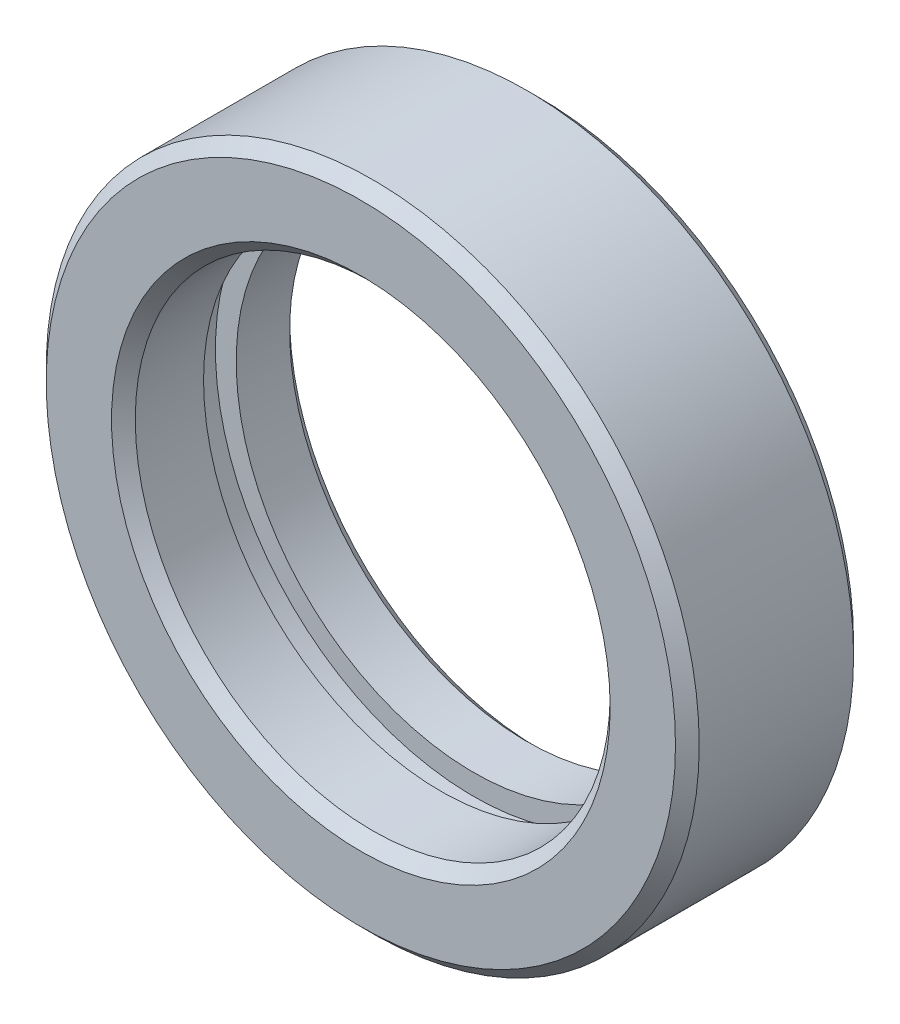
ISO-10303-21;
HEADER;
FILE_DESCRIPTION(('STEP AP214'),'2;1');
FILE_NAME('part.step','',(''),(''),'','','');
FILE_SCHEMA(('AUTOMOTIVE_DESIGN { 1 0 10303 214 1 1 1 1 }'));
ENDSEC;
DATA;
#1=APPLICATION_CONTEXT('core data for automotive mechanical design processes');
#2=APPLICATION_PROTOCOL_DEFINITION('international standard','automotive_design',2000,#1);
#3=PRODUCT_CONTEXT('',#1,'mechanical');
#4=PRODUCT('Part','Part','',(#3));
#5=PRODUCT_RELATED_PRODUCT_CATEGORY('part','',(#4));
#6=PRODUCT_DEFINITION_FORMATION('','',#4);
#7=PRODUCT_DEFINITION_CONTEXT('part definition',#1,'design');
#8=PRODUCT_DEFINITION('design','',#6,#7);
#9=PRODUCT_DEFINITION_SHAPE('','',#8);
#10=(LENGTH_UNIT() NAMED_UNIT(*) SI_UNIT(.MILLI.,.METRE.));
#11=(NAMED_UNIT(*) PLANE_ANGLE_UNIT() SI_UNIT($,.RADIAN.));
#12=(NAMED_UNIT(*) SI_UNIT($,.STERADIAN.) SOLID_ANGLE_UNIT());
#13=UNCERTAINTY_MEASURE_WITH_UNIT(LENGTH_MEASURE(1.E-05),#10,'distance_accuracy_value','');
#14=(GEOMETRIC_REPRESENTATION_CONTEXT(3) GLOBAL_UNCERTAINTY_ASSIGNED_CONTEXT((#13)) GLOBAL_UNIT_ASSIGNED_CONTEXT((#10,
#11,#12)) REPRESENTATION_CONTEXT('',''));
#15=CARTESIAN_POINT('',(0.,0.,0.));
#16=DIRECTION('',(0.,0.,1.));
#17=DIRECTION('',(1.,0.,0.));
#18=AXIS2_PLACEMENT_3D('',#15,#16,#17);
#19=CARTESIAN_POINT('',(0.,0.,15.));
#20=DIRECTION('',(0.,0.,-1.));
#21=DIRECTION('',(-1.,0.,0.));
#22=AXIS2_PLACEMENT_3D('',#19,#20,#21);
#23=CYLINDRICAL_SURFACE('',#22,40.);
#24=CARTESIAN_POINT('',(0.,0.,13.));
#25=DIRECTION('',(0.,0.,1.));
#26=DIRECTION('',(1.,0.,0.));
#27=AXIS2_PLACEMENT_3D('',#24,#25,#26);
#28=CIRCLE('',#27,40.);
#29=CARTESIAN_POINT('',(40.,0.,13.));
#30=VERTEX_POINT('',#29);
#31=EDGE_CURVE('E66',#30,#30,#28,.T.);
#32=ORIENTED_EDGE('',*,*,#31,.T.);
#33=EDGE_LOOP('',(#32));
#34=FACE_BOUND('',#33,.T.);
#35=CARTESIAN_POINT('',(0.,0.,1.5));
#36=DIRECTION('',(0.,0.,-1.));
#37=DIRECTION('',(-1.,0.,0.));
#38=AXIS2_PLACEMENT_3D('',#35,#36,#37);
#39=CIRCLE('',#38,40.);
#40=CARTESIAN_POINT('',(-40.,0.,1.5));
#41=VERTEX_POINT('',#40);
#42=EDGE_CURVE('E34',#41,#41,#39,.T.);
#43=ORIENTED_EDGE('',*,*,#42,.T.);
#44=EDGE_LOOP('',(#43));
#45=FACE_BOUND('',#44,.T.);
#46=ADVANCED_FACE('F30',(#34,#45),#23,.F.);
#47=CARTESIAN_POINT('',(0.,0.,-13.));
#48=DIRECTION('',(0.,0.,1.));
#49=DIRECTION('',(1.,0.,0.));
#50=AXIS2_PLACEMENT_3D('',#47,#48,#49);
#51=CIRCLE('',#50,40.);
#52=CARTESIAN_POINT('',(40.,0.,-13.));
#53=VERTEX_POINT('',#52);
#54=EDGE_CURVE('E69',#53,#53,#51,.F.);
#55=ORIENTED_EDGE('',*,*,#54,.T.);
#56=EDGE_LOOP('',(#55));
#57=FACE_BOUND('',#56,.T.);
#58=CARTESIAN_POINT('',(0.,0.,-4.));
#59=DIRECTION('',(0.,0.,1.));
#60=DIRECTION('',(1.,0.,0.));
#61=AXIS2_PLACEMENT_3D('',#58,#59,#60);
#62=CIRCLE('',#61,40.);
#63=CARTESIAN_POINT('',(40.,0.,-4.));
#64=VERTEX_POINT('',#63);
#65=EDGE_CURVE('E46',#64,#64,#62,.T.);
#66=ORIENTED_EDGE('',*,*,#65,.T.);
#67=EDGE_LOOP('',(#66));
#68=FACE_BOUND('',#67,.T.);
#69=ADVANCED_FACE('F90',(#57,#68),#23,.F.);
#70=CARTESIAN_POINT('',(0.,0.,15.));
#71=DIRECTION('',(0.,0.,1.));
#72=DIRECTION('',(1.,0.,0.));
#73=AXIS2_PLACEMENT_3D('',#70,#71,#72);
#74=PLANE('',#73);
#75=CARTESIAN_POINT('',(0.,0.,15.));
#76=DIRECTION('',(0.,0.,1.));
#77=DIRECTION('',(1.,0.,0.));
#78=AXIS2_PLACEMENT_3D('',#75,#76,#77);
#79=CIRCLE('',#78,42.);
#80=CARTESIAN_POINT('',(42.,0.,15.));
#81=VERTEX_POINT('',#80);
#82=EDGE_CURVE('E43',#81,#81,#79,.F.);
#83=ORIENTED_EDGE('',*,*,#82,.T.);
#84=EDGE_LOOP('',(#83));
#85=FACE_BOUND('',#84,.T.);
#86=CARTESIAN_POINT('',(0.,0.,15.));
#87=DIRECTION('',(0.,0.,1.));
#88=DIRECTION('',(1.,0.,0.));
#89=AXIS2_PLACEMENT_3D('',#86,#87,#88);
#90=CIRCLE('',#89,53.);
#91=CARTESIAN_POINT('',(53.,0.,15.));
#92=VERTEX_POINT('',#91);
#93=EDGE_CURVE('E72',#92,#92,#90,.T.);
#94=ORIENTED_EDGE('',*,*,#93,.T.);
#95=EDGE_LOOP('',(#94));
#96=FACE_BOUND('',#95,.T.);
#97=ADVANCED_FACE('F77',(#85,#96),#74,.T.);
#98=CARTESIAN_POINT('',(0.,0.,-15.));
#99=DIRECTION('',(0.,0.,1.));
#100=DIRECTION('',(1.,0.,0.));
#101=AXIS2_PLACEMENT_3D('',#98,#99,#100);
#102=PLANE('',#101);
#103=CARTESIAN_POINT('',(0.,0.,-15.));
#104=DIRECTION('',(0.,0.,1.));
#105=DIRECTION('',(1.,0.,0.));
#106=AXIS2_PLACEMENT_3D('',#103,#104,#105);
#107=CIRCLE('',#106,42.);
#108=CARTESIAN_POINT('',(42.,0.,-15.));
#109=VERTEX_POINT('',#108);
#110=EDGE_CURVE('E63',#109,#109,#107,.T.);
#111=ORIENTED_EDGE('',*,*,#110,.T.);
#112=EDGE_LOOP('',(#111));
#113=FACE_BOUND('',#112,.T.);
#114=CARTESIAN_POINT('',(0.,0.,-15.));
#115=DIRECTION('',(0.,0.,1.));
#116=DIRECTION('',(1.,0.,0.));
#117=AXIS2_PLACEMENT_3D('',#114,#115,#116);
#118=CIRCLE('',#117,53.);
#119=CARTESIAN_POINT('',(53.,0.,-15.));
#120=VERTEX_POINT('',#119);
#121=EDGE_CURVE('E52',#120,#120,#118,.F.);
#122=ORIENTED_EDGE('',*,*,#121,.T.);
#123=EDGE_LOOP('',(#122));
#124=FACE_BOUND('',#123,.T.);
#125=ADVANCED_FACE('F111',(#113,#124),#102,.F.);
#126=CARTESIAN_POINT('',(0.,0.,15.));
#127=DIRECTION('',(0.,0.,-1.));
#128=DIRECTION('',(-1.,0.,0.));
#129=AXIS2_PLACEMENT_3D('',#126,#127,#128);
#130=CYLINDRICAL_SURFACE('',#129,55.);
#131=CARTESIAN_POINT('',(0.,0.,-13.));
#132=DIRECTION('',(0.,0.,1.));
#133=DIRECTION('',(1.,0.,0.));
#134=AXIS2_PLACEMENT_3D('',#131,#132,#133);
#135=CIRCLE('',#134,55.);
#136=CARTESIAN_POINT('',(55.,0.,-13.));
#137=VERTEX_POINT('',#136);
#138=EDGE_CURVE('E10',#137,#137,#135,.T.);
#139=ORIENTED_EDGE('',*,*,#138,.T.);
#140=EDGE_LOOP('',(#139));
#141=FACE_BOUND('',#140,.T.);
#142=CARTESIAN_POINT('',(0.,0.,13.));
#143=DIRECTION('',(0.,0.,1.));
#144=DIRECTION('',(1.,0.,0.));
#145=AXIS2_PLACEMENT_3D('',#142,#143,#144);
#146=CIRCLE('',#145,55.);
#147=CARTESIAN_POINT('',(55.,0.,13.));
#148=VERTEX_POINT('',#147);
#149=EDGE_CURVE('E38',#148,#148,#146,.F.);
#150=ORIENTED_EDGE('',*,*,#149,.T.);
#151=EDGE_LOOP('',(#150));
#152=FACE_BOUND('',#151,.T.);
#153=ADVANCED_FACE('F114',(#141,#152),#130,.T.);
#154=CARTESIAN_POINT('',(0.,0.,-15.));
#155=DIRECTION('',(0.,0.,-1.));
#156=DIRECTION('',(-1.,0.,0.));
#157=AXIS2_PLACEMENT_3D('',#154,#155,#156);
#158=CONICAL_SURFACE('',#157,42.,0.785398163397448);
#159=ORIENTED_EDGE('',*,*,#54,.F.);
#160=EDGE_LOOP('',(#159));
#161=FACE_BOUND('',#160,.T.);
#162=ORIENTED_EDGE('',*,*,#110,.F.);
#163=EDGE_LOOP('',(#162));
#164=FACE_BOUND('',#163,.T.);
#165=ADVANCED_FACE('F84',(#161,#164),#158,.F.);
#166=CARTESIAN_POINT('',(0.,0.,13.));
#167=DIRECTION('',(0.,0.,1.));
#168=DIRECTION('',(1.,0.,0.));
#169=AXIS2_PLACEMENT_3D('',#166,#167,#168);
#170=CONICAL_SURFACE('',#169,40.,0.785398163397448);
#171=ORIENTED_EDGE('',*,*,#82,.F.);
#172=EDGE_LOOP('',(#171));
#173=FACE_BOUND('',#172,.T.);
#174=ORIENTED_EDGE('',*,*,#31,.F.);
#175=EDGE_LOOP('',(#174));
#176=FACE_BOUND('',#175,.T.);
#177=ADVANCED_FACE('F80',(#173,#176),#170,.F.);
#178=CARTESIAN_POINT('',(0.,0.,-13.));
#179=DIRECTION('',(0.,0.,1.));
#180=DIRECTION('',(1.,0.,0.));
#181=AXIS2_PLACEMENT_3D('',#178,#179,#180);
#182=CONICAL_SURFACE('',#181,55.,0.785398163397447);
#183=ORIENTED_EDGE('',*,*,#121,.F.);
#184=EDGE_LOOP('',(#183));
#185=FACE_BOUND('',#184,.T.);
#186=ORIENTED_EDGE('',*,*,#138,.F.);
#187=EDGE_LOOP('',(#186));
#188=FACE_BOUND('',#187,.T.);
#189=ADVANCED_FACE('F83',(#185,#188),#182,.T.);
#190=CARTESIAN_POINT('',(0.,0.,15.));
#191=DIRECTION('',(0.,0.,-1.));
#192=DIRECTION('',(-1.,0.,0.));
#193=AXIS2_PLACEMENT_3D('',#190,#191,#192);
#194=CONICAL_SURFACE('',#193,53.,0.78539816339745);
#195=ORIENTED_EDGE('',*,*,#149,.F.);
#196=EDGE_LOOP('',(#195));
#197=FACE_BOUND('',#196,.T.);
#198=ORIENTED_EDGE('',*,*,#93,.F.);
#199=EDGE_LOOP('',(#198));
#200=FACE_BOUND('',#199,.T.);
#201=ADVANCED_FACE('F32',(#197,#200),#194,.T.);
#202=CARTESIAN_POINT('',(-35.58579704294,0.,1.5));
#203=DIRECTION('',(0.,0.,-1.));
#204=DIRECTION('',(-1.,0.,0.));
#205=AXIS2_PLACEMENT_3D('',#202,#203,#204);
#206=PLANE('',#205);
#207=ORIENTED_EDGE('',*,*,#42,.F.);
#208=EDGE_LOOP('',(#207));
#209=FACE_BOUND('',#208,.T.);
#210=CARTESIAN_POINT('',(0.,0.,1.5));
#211=DIRECTION('',(0.,0.,1.));
#212=DIRECTION('',(1.,0.,0.));
#213=AXIS2_PLACEMENT_3D('',#210,#211,#212);
#214=CIRCLE('',#213,43.5);
#215=CARTESIAN_POINT('',(43.5,0.,1.5));
#216=VERTEX_POINT('',#215);
#217=EDGE_CURVE('E48',#216,#216,#214,.T.);
#218=ORIENTED_EDGE('',*,*,#217,.F.);
#219=EDGE_LOOP('',(#218));
#220=FACE_BOUND('',#219,.T.);
#221=ADVANCED_FACE('F94',(#209,#220),#206,.T.);
#222=CARTESIAN_POINT('',(0.,0.,0.));
#223=DIRECTION('',(0.,0.,1.));
#224=DIRECTION('',(1.,0.,0.));
#225=AXIS2_PLACEMENT_3D('',#222,#223,#224);
#226=CYLINDRICAL_SURFACE('',#225,43.5);
#227=ORIENTED_EDGE('',*,*,#217,.T.);
#228=EDGE_LOOP('',(#227));
#229=FACE_BOUND('',#228,.T.);
#230=CARTESIAN_POINT('',(0.,0.,-4.));
#231=DIRECTION('',(0.,0.,1.));
#232=DIRECTION('',(1.,0.,0.));
#233=AXIS2_PLACEMENT_3D('',#230,#231,#232);
#234=CIRCLE('',#233,43.5);
#235=CARTESIAN_POINT('',(43.5,0.,-4.));
#236=VERTEX_POINT('',#235);
#237=EDGE_CURVE('E54',#236,#236,#234,.T.);
#238=ORIENTED_EDGE('',*,*,#237,.F.);
#239=EDGE_LOOP('',(#238));
#240=FACE_BOUND('',#239,.T.);
#241=ADVANCED_FACE('F97',(#229,#240),#226,.F.);
#242=CARTESIAN_POINT('',(-35.58579704294,0.,-4.));
#243=DIRECTION('',(0.,0.,1.));
#244=DIRECTION('',(1.,0.,0.));
#245=AXIS2_PLACEMENT_3D('',#242,#243,#244);
#246=PLANE('',#245);
#247=ORIENTED_EDGE('',*,*,#65,.F.);
#248=EDGE_LOOP('',(#247));
#249=FACE_BOUND('',#248,.T.);
#250=ORIENTED_EDGE('',*,*,#237,.T.);
#251=EDGE_LOOP('',(#250));
#252=FACE_BOUND('',#251,.T.);
#253=ADVANCED_FACE('F103',(#249,#252),#246,.T.);
#254=CLOSED_SHELL('',(#46,#69,#97,#125,#153,#165,#177,#189,#201,#221,#241,#253));
#255=MANIFOLD_SOLID_BREP('B2',#254);
#256=ADVANCED_BREP_SHAPE_REPRESENTATION('',(#18,#255),#14);
#257=SHAPE_DEFINITION_REPRESENTATION(#9,#256);
ENDSEC;
END-ISO-10303-21;
